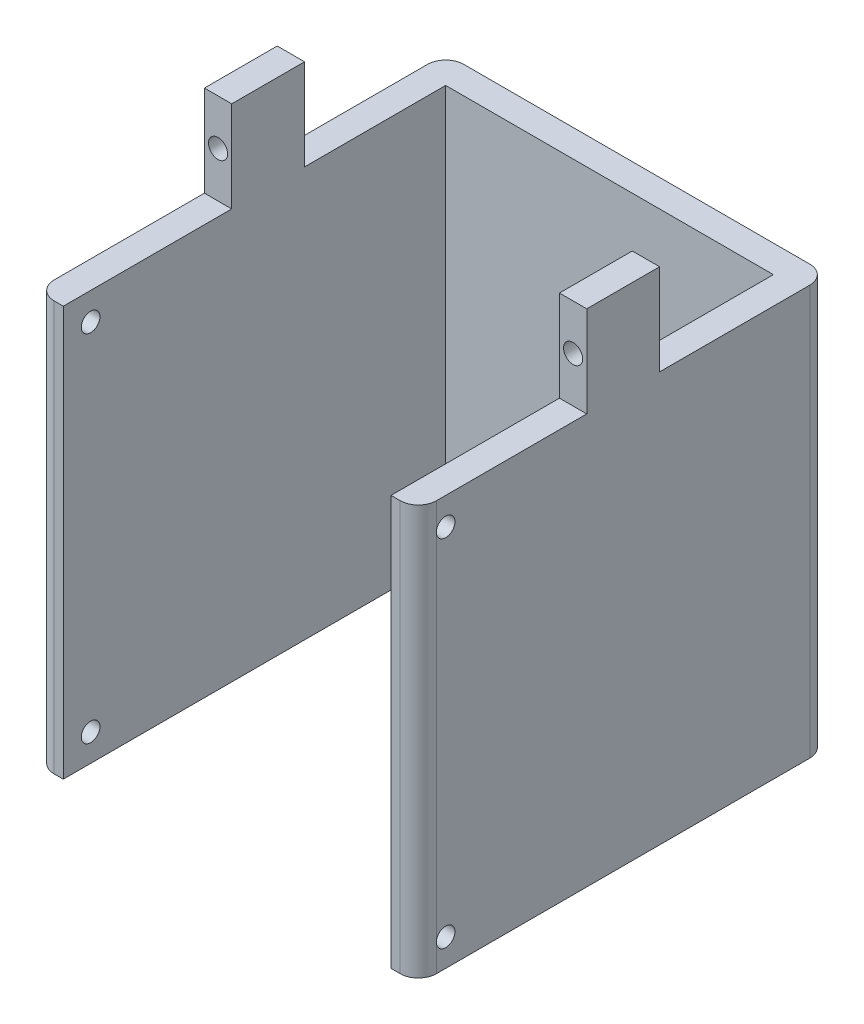
ISO-10303-21;
HEADER;
FILE_DESCRIPTION(('STEP AP214'),'2;1');
FILE_NAME('part.step','',(''),(''),'','','');
FILE_SCHEMA(('AUTOMOTIVE_DESIGN { 1 0 10303 214 1 1 1 1 }'));
ENDSEC;
DATA;
#1=APPLICATION_CONTEXT('core data for automotive mechanical design processes');
#2=APPLICATION_PROTOCOL_DEFINITION('international standard','automotive_design',2000,#1);
#3=PRODUCT_CONTEXT('',#1,'mechanical');
#4=PRODUCT('Part','Part','',(#3));
#5=PRODUCT_RELATED_PRODUCT_CATEGORY('part','',(#4));
#6=PRODUCT_DEFINITION_FORMATION('','',#4);
#7=PRODUCT_DEFINITION_CONTEXT('part definition',#1,'design');
#8=PRODUCT_DEFINITION('design','',#6,#7);
#9=PRODUCT_DEFINITION_SHAPE('','',#8);
#10=(LENGTH_UNIT() NAMED_UNIT(*) SI_UNIT(.MILLI.,.METRE.));
#11=(NAMED_UNIT(*) PLANE_ANGLE_UNIT() SI_UNIT($,.RADIAN.));
#12=(NAMED_UNIT(*) SI_UNIT($,.STERADIAN.) SOLID_ANGLE_UNIT());
#13=UNCERTAINTY_MEASURE_WITH_UNIT(LENGTH_MEASURE(1.E-05),#10,'distance_accuracy_value','');
#14=(GEOMETRIC_REPRESENTATION_CONTEXT(3) GLOBAL_UNCERTAINTY_ASSIGNED_CONTEXT((#13)) GLOBAL_UNIT_ASSIGNED_CONTEXT((#10,
#11,#12)) REPRESENTATION_CONTEXT('',''));
#15=CARTESIAN_POINT('',(0.,0.,0.));
#16=DIRECTION('',(0.,0.,1.));
#17=DIRECTION('',(1.,0.,0.));
#18=AXIS2_PLACEMENT_3D('',#15,#16,#17);
#19=CARTESIAN_POINT('',(-13.5454545454545,-28.0909090909091,38.));
#20=DIRECTION('',(0.,1.,0.));
#21=DIRECTION('',(0.,0.,1.));
#22=AXIS2_PLACEMENT_3D('',#19,#20,#21);
#23=CYLINDRICAL_SURFACE('',#22,2.);
#24=DIRECTION('',(0.,1.,0.));
#25=VECTOR('',#24,1.);
#26=CARTESIAN_POINT('',(-15.5454545454545,-28.0909090909091,38.));
#27=LINE('',#26,#25);
#28=CARTESIAN_POINT('',(-15.5454545454545,-28.0909090909091,38.));
#29=VERTEX_POINT('',#28);
#30=CARTESIAN_POINT('',(-15.5454545454545,-25.3159090909091,38.));
#31=VERTEX_POINT('',#30);
#32=EDGE_CURVE('E442',#29,#31,#27,.T.);
#33=ORIENTED_EDGE('',*,*,#32,.F.);
#34=CARTESIAN_POINT('',(-13.5454545454545,-28.0909090909091,38.));
#35=DIRECTION('',(0.,-1.,0.));
#36=DIRECTION('',(0.,0.,-1.));
#37=AXIS2_PLACEMENT_3D('',#34,#35,#36);
#38=CIRCLE('',#37,2.);
#39=CARTESIAN_POINT('',(-13.5454545454545,-28.0909090909091,40.));
#40=VERTEX_POINT('',#39);
#41=EDGE_CURVE('E44',#40,#29,#38,.T.);
#42=ORIENTED_EDGE('',*,*,#41,.F.);
#43=DIRECTION('',(0.,1.,0.));
#44=VECTOR('',#43,1.);
#45=CARTESIAN_POINT('',(-13.5454545454545,0.,40.));
#46=LINE('',#45,#44);
#47=CARTESIAN_POINT('',(-13.5454545454545,16.9090909090909,40.));
#48=VERTEX_POINT('',#47);
#49=EDGE_CURVE('E428',#48,#40,#46,.F.);
#50=ORIENTED_EDGE('',*,*,#49,.F.);
#51=CARTESIAN_POINT('',(-13.5454545454545,16.9090909090909,38.));
#52=DIRECTION('',(0.,1.,0.));
#53=DIRECTION('',(0.,0.,1.));
#54=AXIS2_PLACEMENT_3D('',#51,#52,#53);
#55=CIRCLE('',#54,2.);
#56=CARTESIAN_POINT('',(-15.5454545454545,16.9090909090909,38.));
#57=VERTEX_POINT('',#56);
#58=EDGE_CURVE('E11',#57,#48,#55,.T.);
#59=ORIENTED_EDGE('',*,*,#58,.F.);
#60=DIRECTION('',(0.,1.,0.));
#61=VECTOR('',#60,1.);
#62=CARTESIAN_POINT('',(-15.5454545454545,-28.0909090909091,38.));
#63=LINE('',#62,#61);
#64=CARTESIAN_POINT('',(-15.5454545454545,14.1340909090909,38.));
#65=VERTEX_POINT('',#64);
#66=EDGE_CURVE('E471',#65,#57,#63,.T.);
#67=ORIENTED_EDGE('',*,*,#66,.F.);
#68=CARTESIAN_POINT('',(-15.5454545454545,13.6840909090909,38.));
#69=CARTESIAN_POINT('',(-15.5454509486003,13.7126078027964,38.0064168164898));
#70=CARTESIAN_POINT('',(-15.5454240768481,13.7413871701402,38.0116095084588));
#71=CARTESIAN_POINT('',(-15.5453638825628,13.7992817057305,38.0195198736351));
#72=CARTESIAN_POINT('',(-15.5453305605444,13.8283968470134,38.0222377441936));
#73=CARTESIAN_POINT('',(-15.5452819861899,13.9143077071115,38.0265566954337));
#74=CARTESIAN_POINT('',(-15.5453134118341,13.9713133459579,38.0246872628044));
#75=CARTESIAN_POINT('',(-15.5454317586012,14.0842271056491,38.0115251227635));
#76=CARTESIAN_POINT('',(-15.545518680604,14.1401352090795,38.0002322659568));
#77=CARTESIAN_POINT('',(-15.545329510473,14.2227506643284,37.9762679396794));
#78=CARTESIAN_POINT('',(-15.5452091314313,14.2504606359999,37.9669257742961));
#79=CARTESIAN_POINT('',(-15.544750165416,14.304983678151,37.9459108658791));
#80=CARTESIAN_POINT('',(-15.5444115551763,14.3317966526792,37.9342378744426));
#81=CARTESIAN_POINT('',(-15.5439108237709,14.3580709330301,37.9214347172229));
#82=B_SPLINE_CURVE_WITH_KNOTS('',3,(#68,#69,#70,#71,#72,#73,#74,#75,#76,#77,#78,#79,#80,#81),
.UNSPECIFIED.,.F.,.F.,(4,2,2,2,2,2,4),(0.,0.0876379687174867,0.175268948251648,
0.345543195462555,0.515820142180702,0.603453215854345,0.691095633826563),.UNSPECIFIED.);
#83=CARTESIAN_POINT('',(-15.5454545454545,13.6840909090909,38.));
#84=VERTEX_POINT('',#83);
#85=EDGE_CURVE('E421',#84,#65,#82,.T.);
#86=ORIENTED_EDGE('',*,*,#85,.F.);
#87=DIRECTION('',(0.,1.,0.));
#88=VECTOR('',#87,1.);
#89=CARTESIAN_POINT('',(-15.5454545454545,-28.0909090909091,38.));
#90=LINE('',#89,#88);
#91=CARTESIAN_POINT('',(-15.5454545454545,-24.8659090909091,38.));
#92=VERTEX_POINT('',#91);
#93=EDGE_CURVE('E445',#92,#84,#90,.T.);
#94=ORIENTED_EDGE('',*,*,#93,.F.);
#95=CARTESIAN_POINT('',(-15.5454545454545,-25.3159090909091,38.));
#96=CARTESIAN_POINT('',(-15.5454509486003,-25.2873921972036,38.0064168164898));
#97=CARTESIAN_POINT('',(-15.5454240768481,-25.2586128298598,38.0116095084588));
#98=CARTESIAN_POINT('',(-15.5453638825628,-25.2007182942695,38.0195198736351));
#99=CARTESIAN_POINT('',(-15.5453305605444,-25.1716031529866,38.0222377441936));
#100=CARTESIAN_POINT('',(-15.5452819861899,-25.0856922928885,38.0265566954337));
#101=CARTESIAN_POINT('',(-15.5453134118341,-25.0286866540421,38.0246872628044));
#102=CARTESIAN_POINT('',(-15.5454317586012,-24.9157728943509,38.0115251227635));
#103=CARTESIAN_POINT('',(-15.545518680604,-24.8598647909205,38.0002322659568));
#104=CARTESIAN_POINT('',(-15.545329510473,-24.7772493356715,37.9762679396794));
#105=CARTESIAN_POINT('',(-15.5452091314313,-24.7495393640001,37.9669257742961));
#106=CARTESIAN_POINT('',(-15.544750165416,-24.695016321849,37.9459108658791));
#107=CARTESIAN_POINT('',(-15.5444115551763,-24.6682033473208,37.9342378744426));
#108=CARTESIAN_POINT('',(-15.5439108237709,-24.6419290669699,37.9214347172229));
#109=B_SPLINE_CURVE_WITH_KNOTS('',3,(#95,#96,#97,#98,#99,#100,#101,#102,#103,#104,#105,#106,
#107,#108),.UNSPECIFIED.,.F.,.F.,(4,2,2,2,2,2,4),(0.,0.0876379687174879,0.175268948251652,
0.345543195462558,0.515820142180715,0.603453215854358,0.691095633826572),.UNSPECIFIED.);
#110=EDGE_CURVE('E429',#31,#92,#109,.T.);
#111=ORIENTED_EDGE('',*,*,#110,.F.);
#112=EDGE_LOOP('',(#33,#42,#50,#59,#67,#86,#94,#111));
#113=FACE_BOUND('',#112,.T.);
#114=ADVANCED_FACE('F36',(#113),#23,.T.);
#115=CARTESIAN_POINT('',(24.4545454545455,-28.0909090909091,38.));
#116=DIRECTION('',(0.,1.,0.));
#117=DIRECTION('',(0.,0.,1.));
#118=AXIS2_PLACEMENT_3D('',#115,#116,#117);
#119=CYLINDRICAL_SURFACE('',#118,2.);
#120=DIRECTION('',(0.,-1.,0.));
#121=VECTOR('',#120,1.);
#122=CARTESIAN_POINT('',(26.4545454545455,-28.0909090909091,38.));
#123=LINE('',#122,#121);
#124=CARTESIAN_POINT('',(26.4545454545455,16.9090909090909,38.));
#125=VERTEX_POINT('',#124);
#126=CARTESIAN_POINT('',(26.4545454545455,14.1340909090909,38.));
#127=VERTEX_POINT('',#126);
#128=EDGE_CURVE('E387',#125,#127,#123,.T.);
#129=ORIENTED_EDGE('',*,*,#128,.F.);
#130=CARTESIAN_POINT('',(24.4545454545455,16.9090909090909,38.));
#131=DIRECTION('',(0.,1.,0.));
#132=DIRECTION('',(0.,0.,1.));
#133=AXIS2_PLACEMENT_3D('',#130,#131,#132);
#134=CIRCLE('',#133,2.);
#135=CARTESIAN_POINT('',(24.4545454545455,16.9090909090909,40.));
#136=VERTEX_POINT('',#135);
#137=EDGE_CURVE('E472',#136,#125,#134,.T.);
#138=ORIENTED_EDGE('',*,*,#137,.F.);
#139=DIRECTION('',(0.,-1.,0.));
#140=VECTOR('',#139,1.);
#141=CARTESIAN_POINT('',(24.4545454545455,-28.0909090909091,40.));
#142=LINE('',#141,#140);
#143=CARTESIAN_POINT('',(24.4545454545455,-28.0909090909091,40.));
#144=VERTEX_POINT('',#143);
#145=EDGE_CURVE('E475',#144,#136,#142,.F.);
#146=ORIENTED_EDGE('',*,*,#145,.F.);
#147=CARTESIAN_POINT('',(24.4545454545455,-28.0909090909091,38.));
#148=DIRECTION('',(0.,-1.,0.));
#149=DIRECTION('',(0.,0.,-1.));
#150=AXIS2_PLACEMENT_3D('',#147,#148,#149);
#151=CIRCLE('',#150,2.);
#152=CARTESIAN_POINT('',(26.4545454545455,-28.0909090909091,38.));
#153=VERTEX_POINT('',#152);
#154=EDGE_CURVE('E466',#153,#144,#151,.T.);
#155=ORIENTED_EDGE('',*,*,#154,.F.);
#156=DIRECTION('',(0.,-1.,0.));
#157=VECTOR('',#156,1.);
#158=CARTESIAN_POINT('',(26.4545454545455,-28.0909090909091,38.));
#159=LINE('',#158,#157);
#160=CARTESIAN_POINT('',(26.4545454545455,-25.3159090909091,38.));
#161=VERTEX_POINT('',#160);
#162=EDGE_CURVE('E381',#161,#153,#159,.T.);
#163=ORIENTED_EDGE('',*,*,#162,.F.);
#164=CARTESIAN_POINT('',(26.4545454545455,-24.8659090909091,38.));
#165=CARTESIAN_POINT('',(26.4545418576912,-24.8944259846145,38.0064168164898));
#166=CARTESIAN_POINT('',(26.454514985939,-24.9232053519584,38.0116095084588));
#167=CARTESIAN_POINT('',(26.4544547916537,-24.9810998875486,38.0195198736351));
#168=CARTESIAN_POINT('',(26.4544214696353,-25.0102150288316,38.0222377441936));
#169=CARTESIAN_POINT('',(26.4543728952808,-25.0961258889297,38.0265566954337));
#170=CARTESIAN_POINT('',(26.454404320925,-25.1531315277761,38.0246872628044));
#171=CARTESIAN_POINT('',(26.4545226676921,-25.2660452874673,38.0115251227635));
#172=CARTESIAN_POINT('',(26.4546095896949,-25.3219533908977,38.0002322659568));
#173=CARTESIAN_POINT('',(26.454420419564,-25.4045688461466,37.9762679396794));
#174=CARTESIAN_POINT('',(26.4543000405222,-25.4322788178181,37.9669257742961));
#175=CARTESIAN_POINT('',(26.4538410745069,-25.4868018599692,37.9459108658791));
#176=CARTESIAN_POINT('',(26.4535024642672,-25.5136148344973,37.9342378744426));
#177=CARTESIAN_POINT('',(26.4530017328618,-25.5398891148483,37.9214347172229));
#178=B_SPLINE_CURVE_WITH_KNOTS('',3,(#164,#165,#166,#167,#168,#169,#170,#171,#172,#173,#174,
#175,#176,#177),.UNSPECIFIED.,.F.,.F.,(4,2,2,2,2,2,4),(0.,0.0876379687174833,0.175268948251648,
0.345543195462557,0.515820142180701,0.603453215854352,0.691095633826572),.UNSPECIFIED.);
#179=CARTESIAN_POINT('',(26.4545454545455,-24.8659090909091,38.));
#180=VERTEX_POINT('',#179);
#181=EDGE_CURVE('E397',#180,#161,#178,.T.);
#182=ORIENTED_EDGE('',*,*,#181,.F.);
#183=DIRECTION('',(0.,-1.,0.));
#184=VECTOR('',#183,1.);
#185=CARTESIAN_POINT('',(26.4545454545455,-28.0909090909091,38.));
#186=LINE('',#185,#184);
#187=CARTESIAN_POINT('',(26.4545454545455,13.6840909090909,38.));
#188=VERTEX_POINT('',#187);
#189=EDGE_CURVE('E384',#188,#180,#186,.T.);
#190=ORIENTED_EDGE('',*,*,#189,.F.);
#191=CARTESIAN_POINT('',(26.4545454545455,14.1340909090909,38.));
#192=CARTESIAN_POINT('',(26.4545418576912,14.1055740153855,38.0064168164898));
#193=CARTESIAN_POINT('',(26.454514985939,14.0767946480416,38.0116095084588));
#194=CARTESIAN_POINT('',(26.4544547916537,14.0189001124514,38.0195198736351));
#195=CARTESIAN_POINT('',(26.4544214696353,13.9897849711684,38.0222377441936));
#196=CARTESIAN_POINT('',(26.4543728952808,13.9038741110704,38.0265566954337));
#197=CARTESIAN_POINT('',(26.454404320925,13.8468684722239,38.0246872628044));
#198=CARTESIAN_POINT('',(26.4545226676921,13.7339547125327,38.0115251227635));
#199=CARTESIAN_POINT('',(26.4546095896949,13.6780466091023,38.0002322659568));
#200=CARTESIAN_POINT('',(26.454420419564,13.5954311538534,37.9762679396794));
#201=CARTESIAN_POINT('',(26.4543000405222,13.5677211821819,37.9669257742961));
#202=CARTESIAN_POINT('',(26.4538410745069,13.5131981400308,37.9459108658791));
#203=CARTESIAN_POINT('',(26.4535024642672,13.4863851655027,37.9342378744426));
#204=CARTESIAN_POINT('',(26.4530017328618,13.4601108851518,37.9214347172229));
#205=B_SPLINE_CURVE_WITH_KNOTS('',3,(#191,#192,#193,#194,#195,#196,#197,#198,#199,#200,#201,
#202,#203,#204),.UNSPECIFIED.,.F.,.F.,(4,2,2,2,2,2,4),(0.,0.087637968717485,0.175268948251646,
0.345543195462555,0.515820142180707,0.603453215854347,0.691095633826563),.UNSPECIFIED.);
#206=EDGE_CURVE('E390',#127,#188,#205,.T.);
#207=ORIENTED_EDGE('',*,*,#206,.F.);
#208=EDGE_LOOP('',(#129,#138,#146,#155,#163,#182,#190,#207));
#209=FACE_BOUND('',#208,.T.);
#210=ADVANCED_FACE('F404',(#209),#119,.T.);
#211=CARTESIAN_POINT('',(-13.5454545454545,0.,-3.));
#212=DIRECTION('',(0.,-1.,0.));
#213=DIRECTION('',(0.,0.,-1.));
#214=AXIS2_PLACEMENT_3D('',#211,#212,#213);
#215=CYLINDRICAL_SURFACE('',#214,2.);
#216=DIRECTION('',(0.,1.,0.));
#217=VECTOR('',#216,1.);
#218=CARTESIAN_POINT('',(-13.5454545454545,0.,-5.));
#219=LINE('',#218,#217);
#220=CARTESIAN_POINT('',(-13.5454545454545,-28.0909090909091,-5.));
#221=VERTEX_POINT('',#220);
#222=CARTESIAN_POINT('',(-13.5454545454545,16.9090909090909,-5.));
#223=VERTEX_POINT('',#222);
#224=EDGE_CURVE('E371',#221,#223,#219,.T.);
#225=ORIENTED_EDGE('',*,*,#224,.F.);
#226=CARTESIAN_POINT('',(-13.5454545454545,-28.0909090909091,-3.));
#227=DIRECTION('',(0.,-1.,0.));
#228=DIRECTION('',(0.,0.,-1.));
#229=AXIS2_PLACEMENT_3D('',#226,#227,#228);
#230=CIRCLE('',#229,2.);
#231=CARTESIAN_POINT('',(-15.5454545454545,-28.0909090909091,-3.));
#232=VERTEX_POINT('',#231);
#233=EDGE_CURVE('E377',#232,#221,#230,.T.);
#234=ORIENTED_EDGE('',*,*,#233,.F.);
#235=DIRECTION('',(0.,1.,0.));
#236=VECTOR('',#235,1.);
#237=CARTESIAN_POINT('',(-15.5454545454545,0.,-3.));
#238=LINE('',#237,#236);
#239=CARTESIAN_POINT('',(-15.5454545454545,16.9090909090909,-3.));
#240=VERTEX_POINT('',#239);
#241=EDGE_CURVE('E374',#240,#232,#238,.F.);
#242=ORIENTED_EDGE('',*,*,#241,.F.);
#243=CARTESIAN_POINT('',(-13.5454545454545,16.9090909090909,-3.));
#244=DIRECTION('',(0.,1.,0.));
#245=DIRECTION('',(0.,0.,1.));
#246=AXIS2_PLACEMENT_3D('',#243,#244,#245);
#247=CIRCLE('',#246,2.);
#248=EDGE_CURVE('E379',#223,#240,#247,.T.);
#249=ORIENTED_EDGE('',*,*,#248,.F.);
#250=EDGE_LOOP('',(#225,#234,#242,#249));
#251=FACE_BOUND('',#250,.T.);
#252=ADVANCED_FACE('F450',(#251),#215,.T.);
#253=CARTESIAN_POINT('',(24.4545454545455,0.,-3.));
#254=DIRECTION('',(0.,-1.,0.));
#255=DIRECTION('',(0.,0.,-1.));
#256=AXIS2_PLACEMENT_3D('',#253,#254,#255);
#257=CYLINDRICAL_SURFACE('',#256,2.);
#258=DIRECTION('',(0.,-1.,0.));
#259=VECTOR('',#258,1.);
#260=CARTESIAN_POINT('',(24.4545454545455,0.,-5.));
#261=LINE('',#260,#259);
#262=CARTESIAN_POINT('',(24.4545454545455,16.9090909090909,-5.));
#263=VERTEX_POINT('',#262);
#264=CARTESIAN_POINT('',(24.4545454545455,-28.0909090909091,-5.));
#265=VERTEX_POINT('',#264);
#266=EDGE_CURVE('E351',#263,#265,#261,.T.);
#267=ORIENTED_EDGE('',*,*,#266,.F.);
#268=CARTESIAN_POINT('',(24.4545454545455,16.9090909090909,-3.));
#269=DIRECTION('',(0.,1.,0.));
#270=DIRECTION('',(0.,0.,1.));
#271=AXIS2_PLACEMENT_3D('',#268,#269,#270);
#272=CIRCLE('',#271,2.);
#273=CARTESIAN_POINT('',(26.4545454545455,16.9090909090909,-3.));
#274=VERTEX_POINT('',#273);
#275=EDGE_CURVE('E366',#274,#263,#272,.T.);
#276=ORIENTED_EDGE('',*,*,#275,.F.);
#277=DIRECTION('',(0.,-1.,0.));
#278=VECTOR('',#277,1.);
#279=CARTESIAN_POINT('',(26.4545454545455,-28.0909090909091,-3.));
#280=LINE('',#279,#278);
#281=CARTESIAN_POINT('',(26.4545454545455,-28.0909090909091,-3.));
#282=VERTEX_POINT('',#281);
#283=EDGE_CURVE('E363',#282,#274,#280,.F.);
#284=ORIENTED_EDGE('',*,*,#283,.F.);
#285=CARTESIAN_POINT('',(24.4545454545455,-28.0909090909091,-3.));
#286=DIRECTION('',(0.,-1.,0.));
#287=DIRECTION('',(0.,0.,-1.));
#288=AXIS2_PLACEMENT_3D('',#285,#286,#287);
#289=CIRCLE('',#288,2.);
#290=EDGE_CURVE('E369',#265,#282,#289,.T.);
#291=ORIENTED_EDGE('',*,*,#290,.F.);
#292=EDGE_LOOP('',(#267,#276,#284,#291));
#293=FACE_BOUND('',#292,.T.);
#294=ADVANCED_FACE('F458',(#293),#257,.T.);
#295=CARTESIAN_POINT('',(26.4545454545455,16.9090909090909,-5.));
#296=DIRECTION('',(0.,1.,0.));
#297=DIRECTION('',(0.,0.,1.));
#298=AXIS2_PLACEMENT_3D('',#295,#296,#297);
#299=PLANE('',#298);
#300=DIRECTION('',(0.,0.,1.));
#301=VECTOR('',#300,1.);
#302=CARTESIAN_POINT('',(-15.5454545454545,16.9090909090909,-5.));
#303=LINE('',#302,#301);
#304=CARTESIAN_POINT('',(-15.5454545454545,16.9090909090909,21.5));
#305=VERTEX_POINT('',#304);
#306=EDGE_CURVE('E231',#305,#57,#303,.T.);
#307=ORIENTED_EDGE('',*,*,#306,.T.);
#308=ORIENTED_EDGE('',*,*,#58,.T.);
#309=DIRECTION('',(1.,0.,0.));
#310=VECTOR('',#309,1.);
#311=CARTESIAN_POINT('',(-15.5454545454545,16.9090909090909,40.));
#312=LINE('',#311,#310);
#313=CARTESIAN_POINT('',(-12.5454545454545,16.9090909090909,40.));
#314=VERTEX_POINT('',#313);
#315=EDGE_CURVE('E326',#48,#314,#312,.T.);
#316=ORIENTED_EDGE('',*,*,#315,.T.);
#317=DIRECTION('',(0.,0.,1.));
#318=VECTOR('',#317,1.);
#319=CARTESIAN_POINT('',(-12.5454545454545,16.9090909090909,3.));
#320=LINE('',#319,#318);
#321=CARTESIAN_POINT('',(-12.5454545454545,16.9090909090909,21.5));
#322=VERTEX_POINT('',#321);
#323=EDGE_CURVE('E301',#322,#314,#320,.T.);
#324=ORIENTED_EDGE('',*,*,#323,.F.);
#325=DIRECTION('',(1.,0.,0.));
#326=VECTOR('',#325,1.);
#327=CARTESIAN_POINT('',(-15.5454545454545,16.9090909090909,21.5));
#328=LINE('',#327,#326);
#329=EDGE_CURVE('E359',#305,#322,#328,.T.);
#330=ORIENTED_EDGE('',*,*,#329,.F.);
#331=EDGE_LOOP('',(#307,#308,#316,#324,#330));
#332=FACE_BOUND('',#331,.T.);
#333=ADVANCED_FACE('F526',(#332),#299,.T.);
#334=DIRECTION('',(1.,0.,0.));
#335=VECTOR('',#334,1.);
#336=CARTESIAN_POINT('',(-15.5454545454545,16.9090909090909,-5.));
#337=LINE('',#336,#335);
#338=EDGE_CURVE('E331',#223,#263,#337,.T.);
#339=ORIENTED_EDGE('',*,*,#338,.F.);
#340=ORIENTED_EDGE('',*,*,#248,.T.);
#341=CARTESIAN_POINT('',(-15.5454545454545,16.9090909090909,13.5));
#342=VERTEX_POINT('',#341);
#343=EDGE_CURVE('E339',#240,#342,#303,.T.);
#344=ORIENTED_EDGE('',*,*,#343,.T.);
#345=DIRECTION('',(-1.,0.,0.));
#346=VECTOR('',#345,1.);
#347=CARTESIAN_POINT('',(-15.5454545454545,16.9090909090909,13.5));
#348=LINE('',#347,#346);
#349=CARTESIAN_POINT('',(-12.5454545454545,16.9090909090909,13.5));
#350=VERTEX_POINT('',#349);
#351=EDGE_CURVE('E225',#350,#342,#348,.T.);
#352=ORIENTED_EDGE('',*,*,#351,.F.);
#353=CARTESIAN_POINT('',(-12.5454545454545,16.9090909090909,-2.));
#354=VERTEX_POINT('',#353);
#355=EDGE_CURVE('E304',#354,#350,#320,.T.);
#356=ORIENTED_EDGE('',*,*,#355,.F.);
#357=DIRECTION('',(-1.,0.,0.));
#358=VECTOR('',#357,1.);
#359=CARTESIAN_POINT('',(-12.5454545454545,16.9090909090909,-2.));
#360=LINE('',#359,#358);
#361=CARTESIAN_POINT('',(23.4545454545454,16.9090909090909,-2.));
#362=VERTEX_POINT('',#361);
#363=EDGE_CURVE('E284',#362,#354,#360,.T.);
#364=ORIENTED_EDGE('',*,*,#363,.F.);
#365=DIRECTION('',(0.,0.,-1.));
#366=VECTOR('',#365,1.);
#367=CARTESIAN_POINT('',(23.4545454545455,16.9090909090909,3.));
#368=LINE('',#367,#366);
#369=CARTESIAN_POINT('',(23.4545454545455,16.9090909090909,13.5));
#370=VERTEX_POINT('',#369);
#371=EDGE_CURVE('E307',#370,#362,#368,.T.);
#372=ORIENTED_EDGE('',*,*,#371,.F.);
#373=DIRECTION('',(-1.,0.,0.));
#374=VECTOR('',#373,1.);
#375=CARTESIAN_POINT('',(26.4545454545455,16.9090909090909,13.5));
#376=LINE('',#375,#374);
#377=CARTESIAN_POINT('',(26.4545454545455,16.9090909090909,13.5));
#378=VERTEX_POINT('',#377);
#379=EDGE_CURVE('E232',#378,#370,#376,.T.);
#380=ORIENTED_EDGE('',*,*,#379,.F.);
#381=DIRECTION('',(0.,0.,1.));
#382=VECTOR('',#381,1.);
#383=CARTESIAN_POINT('',(26.4545454545455,16.9090909090909,-5.));
#384=LINE('',#383,#382);
#385=EDGE_CURVE('E337',#274,#378,#384,.T.);
#386=ORIENTED_EDGE('',*,*,#385,.F.);
#387=ORIENTED_EDGE('',*,*,#275,.T.);
#388=EDGE_LOOP('',(#339,#340,#344,#352,#356,#364,#372,#380,#386,#387));
#389=FACE_BOUND('',#388,.T.);
#390=ADVANCED_FACE('F502',(#389),#299,.T.);
#391=CARTESIAN_POINT('',(23.4545454545455,16.9090909090909,40.));
#392=VERTEX_POINT('',#391);
#393=EDGE_CURVE('E325',#392,#136,#312,.T.);
#394=ORIENTED_EDGE('',*,*,#393,.T.);
#395=ORIENTED_EDGE('',*,*,#137,.T.);
#396=CARTESIAN_POINT('',(26.4545454545455,16.9090909090909,21.5));
#397=VERTEX_POINT('',#396);
#398=EDGE_CURVE('E336',#397,#125,#384,.T.);
#399=ORIENTED_EDGE('',*,*,#398,.F.);
#400=DIRECTION('',(1.,0.,0.));
#401=VECTOR('',#400,1.);
#402=CARTESIAN_POINT('',(26.4545454545455,16.9090909090909,21.5));
#403=LINE('',#402,#401);
#404=CARTESIAN_POINT('',(23.4545454545455,16.9090909090909,21.5));
#405=VERTEX_POINT('',#404);
#406=EDGE_CURVE('E235',#405,#397,#403,.T.);
#407=ORIENTED_EDGE('',*,*,#406,.F.);
#408=EDGE_CURVE('E308',#392,#405,#368,.T.);
#409=ORIENTED_EDGE('',*,*,#408,.F.);
#410=EDGE_LOOP('',(#394,#395,#399,#407,#409));
#411=FACE_BOUND('',#410,.T.);
#412=ADVANCED_FACE('F487',(#411),#299,.T.);
#413=CARTESIAN_POINT('',(0.,0.,40.));
#414=DIRECTION('',(0.,0.,-1.));
#415=DIRECTION('',(-1.,0.,0.));
#416=AXIS2_PLACEMENT_3D('',#413,#414,#415);
#417=PLANE('',#416);
#418=ORIENTED_EDGE('',*,*,#315,.F.);
#419=ORIENTED_EDGE('',*,*,#49,.T.);
#420=DIRECTION('',(-1.,0.,0.));
#421=VECTOR('',#420,1.);
#422=CARTESIAN_POINT('',(-14.5454545454545,-28.0909090909091,40.));
#423=LINE('',#422,#421);
#424=CARTESIAN_POINT('',(-12.5454545454545,-28.0909090909091,40.));
#425=VERTEX_POINT('',#424);
#426=EDGE_CURVE('E322',#425,#40,#423,.T.);
#427=ORIENTED_EDGE('',*,*,#426,.F.);
#428=DIRECTION('',(0.,1.,0.));
#429=VECTOR('',#428,1.);
#430=CARTESIAN_POINT('',(-12.5454545454545,0.,40.));
#431=LINE('',#430,#429);
#432=EDGE_CURVE('E346',#425,#314,#431,.T.);
#433=ORIENTED_EDGE('',*,*,#432,.T.);
#434=EDGE_LOOP('',(#418,#419,#427,#433));
#435=FACE_BOUND('',#434,.T.);
#436=ADVANCED_FACE('F521',(#435),#417,.F.);
#437=CARTESIAN_POINT('',(-15.5454545454545,-28.0909090909091,-5.));
#438=DIRECTION('',(1.,0.,0.));
#439=DIRECTION('',(0.,0.,-1.));
#440=AXIS2_PLACEMENT_3D('',#437,#438,#439);
#441=PLANE('',#440);
#442=DIRECTION('',(0.,0.,1.));
#443=VECTOR('',#442,1.);
#444=CARTESIAN_POINT('',(-15.5454545454545,-28.0909090909091,-5.));
#445=LINE('',#444,#443);
#446=EDGE_CURVE('E341',#232,#29,#445,.T.);
#447=ORIENTED_EDGE('',*,*,#446,.T.);
#448=ORIENTED_EDGE('',*,*,#32,.T.);
#449=CARTESIAN_POINT('',(-15.5454545454545,-25.0909090909091,37.));
#450=DIRECTION('',(-1.,0.,0.));
#451=DIRECTION('',(0.,0.,1.));
#452=AXIS2_PLACEMENT_3D('',#449,#450,#451);
#453=CIRCLE('',#452,1.025);
#454=EDGE_CURVE('E265',#92,#31,#453,.T.);
#455=ORIENTED_EDGE('',*,*,#454,.F.);
#456=ORIENTED_EDGE('',*,*,#93,.T.);
#457=CARTESIAN_POINT('',(-15.5454545454545,13.9090909090909,37.));
#458=DIRECTION('',(-1.,0.,0.));
#459=DIRECTION('',(0.,0.,1.));
#460=AXIS2_PLACEMENT_3D('',#457,#458,#459);
#461=CIRCLE('',#460,1.025);
#462=EDGE_CURVE('E264',#65,#84,#461,.T.);
#463=ORIENTED_EDGE('',*,*,#462,.F.);
#464=ORIENTED_EDGE('',*,*,#66,.T.);
#465=ORIENTED_EDGE('',*,*,#306,.F.);
#466=DIRECTION('',(0.,-1.,0.));
#467=VECTOR('',#466,1.);
#468=CARTESIAN_POINT('',(-15.5454545454545,26.9090909090909,21.5));
#469=LINE('',#468,#467);
#470=CARTESIAN_POINT('',(-15.5454545454545,26.9090909090909,21.5));
#471=VERTEX_POINT('',#470);
#472=EDGE_CURVE('E210',#471,#305,#469,.T.);
#473=ORIENTED_EDGE('',*,*,#472,.F.);
#474=DIRECTION('',(0.,0.,1.));
#475=VECTOR('',#474,1.);
#476=CARTESIAN_POINT('',(-15.5454545454545,26.9090909090909,13.5));
#477=LINE('',#476,#475);
#478=CARTESIAN_POINT('',(-15.5454545454545,26.9090909090909,13.5));
#479=VERTEX_POINT('',#478);
#480=EDGE_CURVE('E216',#479,#471,#477,.T.);
#481=ORIENTED_EDGE('',*,*,#480,.F.);
#482=DIRECTION('',(0.,-1.,0.));
#483=VECTOR('',#482,1.);
#484=CARTESIAN_POINT('',(-15.5454545454545,26.9090909090909,13.5));
#485=LINE('',#484,#483);
#486=EDGE_CURVE('E534',#479,#342,#485,.T.);
#487=ORIENTED_EDGE('',*,*,#486,.T.);
#488=ORIENTED_EDGE('',*,*,#343,.F.);
#489=ORIENTED_EDGE('',*,*,#241,.T.);
#490=EDGE_LOOP('',(#447,#448,#455,#456,#463,#464,#465,#473,#481,#487,#488,#489));
#491=FACE_BOUND('',#490,.T.);
#492=ADVANCED_FACE('F229',(#491),#441,.F.);
#493=CARTESIAN_POINT('',(26.4545454545455,-28.0909090909091,-5.));
#494=DIRECTION('',(1.,0.,0.));
#495=DIRECTION('',(0.,0.,-1.));
#496=AXIS2_PLACEMENT_3D('',#493,#494,#495);
#497=PLANE('',#496);
#498=ORIENTED_EDGE('',*,*,#398,.T.);
#499=ORIENTED_EDGE('',*,*,#128,.T.);
#500=CARTESIAN_POINT('',(26.4545454545455,13.9090909090909,37.));
#501=DIRECTION('',(1.,0.,0.));
#502=DIRECTION('',(0.,0.,-1.));
#503=AXIS2_PLACEMENT_3D('',#500,#501,#502);
#504=CIRCLE('',#503,1.025);
#505=EDGE_CURVE('E274',#188,#127,#504,.T.);
#506=ORIENTED_EDGE('',*,*,#505,.F.);
#507=ORIENTED_EDGE('',*,*,#189,.T.);
#508=CARTESIAN_POINT('',(26.4545454545455,-25.0909090909091,37.));
#509=DIRECTION('',(1.,0.,0.));
#510=DIRECTION('',(0.,0.,-1.));
#511=AXIS2_PLACEMENT_3D('',#508,#509,#510);
#512=CIRCLE('',#511,1.025);
#513=EDGE_CURVE('E281',#161,#180,#512,.T.);
#514=ORIENTED_EDGE('',*,*,#513,.F.);
#515=ORIENTED_EDGE('',*,*,#162,.T.);
#516=DIRECTION('',(0.,0.,1.));
#517=VECTOR('',#516,1.);
#518=CARTESIAN_POINT('',(26.4545454545455,-28.0909090909091,-5.));
#519=LINE('',#518,#517);
#520=EDGE_CURVE('E333',#282,#153,#519,.T.);
#521=ORIENTED_EDGE('',*,*,#520,.F.);
#522=ORIENTED_EDGE('',*,*,#283,.T.);
#523=ORIENTED_EDGE('',*,*,#385,.T.);
#524=DIRECTION('',(0.,-1.,0.));
#525=VECTOR('',#524,1.);
#526=CARTESIAN_POINT('',(26.4545454545455,26.9090909090909,13.5));
#527=LINE('',#526,#525);
#528=CARTESIAN_POINT('',(26.4545454545455,26.9090909090909,13.5));
#529=VERTEX_POINT('',#528);
#530=EDGE_CURVE('E261',#529,#378,#527,.T.);
#531=ORIENTED_EDGE('',*,*,#530,.F.);
#532=DIRECTION('',(0.,0.,-1.));
#533=VECTOR('',#532,1.);
#534=CARTESIAN_POINT('',(26.4545454545455,26.9090909090909,13.5));
#535=LINE('',#534,#533);
#536=CARTESIAN_POINT('',(26.4545454545455,26.9090909090909,21.5));
#537=VERTEX_POINT('',#536);
#538=EDGE_CURVE('E241',#537,#529,#535,.T.);
#539=ORIENTED_EDGE('',*,*,#538,.F.);
#540=DIRECTION('',(0.,-1.,0.));
#541=VECTOR('',#540,1.);
#542=CARTESIAN_POINT('',(26.4545454545455,26.9090909090909,21.5));
#543=LINE('',#542,#541);
#544=EDGE_CURVE('E249',#537,#397,#543,.T.);
#545=ORIENTED_EDGE('',*,*,#544,.T.);
#546=EDGE_LOOP('',(#498,#499,#506,#507,#514,#515,#521,#522,#523,#531,#539,#545));
#547=FACE_BOUND('',#546,.T.);
#548=ADVANCED_FACE('F463',(#547),#497,.T.);
#549=CARTESIAN_POINT('',(-14.5454545454545,-28.0909090909091,-5.));
#550=DIRECTION('',(0.,-1.,0.));
#551=DIRECTION('',(0.,0.,-1.));
#552=AXIS2_PLACEMENT_3D('',#549,#550,#551);
#553=PLANE('',#552);
#554=ORIENTED_EDGE('',*,*,#426,.T.);
#555=ORIENTED_EDGE('',*,*,#41,.T.);
#556=ORIENTED_EDGE('',*,*,#446,.F.);
#557=ORIENTED_EDGE('',*,*,#233,.T.);
#558=DIRECTION('',(-1.,0.,0.));
#559=VECTOR('',#558,1.);
#560=CARTESIAN_POINT('',(-14.5454545454545,-28.0909090909091,-5.));
#561=LINE('',#560,#559);
#562=EDGE_CURVE('E328',#265,#221,#561,.T.);
#563=ORIENTED_EDGE('',*,*,#562,.F.);
#564=ORIENTED_EDGE('',*,*,#290,.T.);
#565=ORIENTED_EDGE('',*,*,#520,.T.);
#566=ORIENTED_EDGE('',*,*,#154,.T.);
#567=CARTESIAN_POINT('',(23.4545454545455,-28.0909090909091,40.));
#568=VERTEX_POINT('',#567);
#569=EDGE_CURVE('E323',#144,#568,#423,.T.);
#570=ORIENTED_EDGE('',*,*,#569,.T.);
#571=DIRECTION('',(0.,0.,1.));
#572=VECTOR('',#571,1.);
#573=CARTESIAN_POINT('',(23.4545454545455,-28.0909090909091,-5.00000000000001));
#574=LINE('',#573,#572);
#575=CARTESIAN_POINT('',(23.4545454545455,-28.0909090909091,3.));
#576=VERTEX_POINT('',#575);
#577=EDGE_CURVE('E315',#576,#568,#574,.T.);
#578=ORIENTED_EDGE('',*,*,#577,.F.);
#579=DIRECTION('',(1.,0.,0.));
#580=VECTOR('',#579,1.);
#581=CARTESIAN_POINT('',(-14.5454545454545,-28.0909090909091,3.));
#582=LINE('',#581,#580);
#583=CARTESIAN_POINT('',(-12.5454545454545,-28.0909090909091,3.));
#584=VERTEX_POINT('',#583);
#585=EDGE_CURVE('E349',#584,#576,#582,.T.);
#586=ORIENTED_EDGE('',*,*,#585,.F.);
#587=DIRECTION('',(0.,0.,-1.));
#588=VECTOR('',#587,1.);
#589=CARTESIAN_POINT('',(-12.5454545454545,-28.0909090909091,-5.));
#590=LINE('',#589,#588);
#591=EDGE_CURVE('E320',#425,#584,#590,.T.);
#592=ORIENTED_EDGE('',*,*,#591,.F.);
#593=EDGE_LOOP('',(#554,#555,#556,#557,#563,#564,#565,#566,#570,#578,#586,#592));
#594=FACE_BOUND('',#593,.T.);
#595=ADVANCED_FACE('F438',(#594),#553,.T.);
#596=CARTESIAN_POINT('',(0.,0.,-5.));
#597=DIRECTION('',(0.,0.,-1.));
#598=DIRECTION('',(-1.,0.,0.));
#599=AXIS2_PLACEMENT_3D('',#596,#597,#598);
#600=PLANE('',#599);
#601=ORIENTED_EDGE('',*,*,#562,.T.);
#602=ORIENTED_EDGE('',*,*,#224,.T.);
#603=ORIENTED_EDGE('',*,*,#338,.T.);
#604=ORIENTED_EDGE('',*,*,#266,.T.);
#605=EDGE_LOOP('',(#601,#602,#603,#604));
#606=FACE_BOUND('',#605,.T.);
#607=ADVANCED_FACE('F454',(#606),#600,.T.);
#608=ORIENTED_EDGE('',*,*,#569,.F.);
#609=ORIENTED_EDGE('',*,*,#145,.T.);
#610=ORIENTED_EDGE('',*,*,#393,.F.);
#611=DIRECTION('',(0.,-1.,0.));
#612=VECTOR('',#611,1.);
#613=CARTESIAN_POINT('',(23.4545454545455,0.,40.));
#614=LINE('',#613,#612);
#615=EDGE_CURVE('E343',#392,#568,#614,.T.);
#616=ORIENTED_EDGE('',*,*,#615,.T.);
#617=EDGE_LOOP('',(#608,#609,#610,#616));
#618=FACE_BOUND('',#617,.T.);
#619=ADVANCED_FACE('F480',(#618),#417,.F.);
#620=CARTESIAN_POINT('',(-12.5454545454545,-33.0909090909091,3.));
#621=DIRECTION('',(-1.,0.,0.));
#622=DIRECTION('',(0.,0.,1.));
#623=AXIS2_PLACEMENT_3D('',#620,#621,#622);
#624=PLANE('',#623);
#625=CARTESIAN_POINT('',(-12.5454545454545,-25.0909090909091,37.));
#626=DIRECTION('',(-1.,0.,0.));
#627=DIRECTION('',(0.,0.,1.));
#628=AXIS2_PLACEMENT_3D('',#625,#626,#627);
#629=CIRCLE('',#628,1.025);
#630=CARTESIAN_POINT('',(-12.5454545454545,-25.0909090909091,38.025));
#631=VERTEX_POINT('',#630);
#632=EDGE_CURVE('E278',#631,#631,#629,.T.);
#633=ORIENTED_EDGE('',*,*,#632,.T.);
#634=EDGE_LOOP('',(#633));
#635=FACE_BOUND('',#634,.T.);
#636=CARTESIAN_POINT('',(-12.5454545454545,13.9090909090909,37.));
#637=DIRECTION('',(-1.,0.,0.));
#638=DIRECTION('',(0.,0.,1.));
#639=AXIS2_PLACEMENT_3D('',#636,#637,#638);
#640=CIRCLE('',#639,1.025);
#641=CARTESIAN_POINT('',(-12.5454545454545,13.9090909090909,38.025));
#642=VERTEX_POINT('',#641);
#643=EDGE_CURVE('E271',#642,#642,#640,.T.);
#644=ORIENTED_EDGE('',*,*,#643,.T.);
#645=EDGE_LOOP('',(#644));
#646=FACE_BOUND('',#645,.T.);
#647=ORIENTED_EDGE('',*,*,#591,.T.);
#648=DIRECTION('',(0.,1.,0.));
#649=VECTOR('',#648,1.);
#650=CARTESIAN_POINT('',(-12.5454545454545,-33.0909090909091,3.));
#651=LINE('',#650,#649);
#652=CARTESIAN_POINT('',(-12.5454545454545,-26.0909090909091,3.));
#653=VERTEX_POINT('',#652);
#654=EDGE_CURVE('E312',#584,#653,#651,.T.);
#655=ORIENTED_EDGE('',*,*,#654,.T.);
#656=DIRECTION('',(0.,0.,1.));
#657=VECTOR('',#656,1.);
#658=CARTESIAN_POINT('',(-12.5454545454545,-26.0909090909091,3.));
#659=LINE('',#658,#657);
#660=CARTESIAN_POINT('',(-12.5454545454545,-26.0909090909091,-2.));
#661=VERTEX_POINT('',#660);
#662=EDGE_CURVE('E285',#661,#653,#659,.T.);
#663=ORIENTED_EDGE('',*,*,#662,.F.);
#664=DIRECTION('',(0.,1.,0.));
#665=VECTOR('',#664,1.);
#666=CARTESIAN_POINT('',(-12.5454545454545,-26.0909090909091,-2.));
#667=LINE('',#666,#665);
#668=EDGE_CURVE('E298',#661,#354,#667,.T.);
#669=ORIENTED_EDGE('',*,*,#668,.T.);
#670=ORIENTED_EDGE('',*,*,#355,.T.);
#671=DIRECTION('',(0.,-1.,0.));
#672=VECTOR('',#671,1.);
#673=CARTESIAN_POINT('',(-12.5454545454545,26.9090909090909,13.5));
#674=LINE('',#673,#672);
#675=CARTESIAN_POINT('',(-12.5454545454545,26.9090909090909,13.5));
#676=VERTEX_POINT('',#675);
#677=EDGE_CURVE('E237',#676,#350,#674,.T.);
#678=ORIENTED_EDGE('',*,*,#677,.F.);
#679=DIRECTION('',(0.,0.,-1.));
#680=VECTOR('',#679,1.);
#681=CARTESIAN_POINT('',(-12.5454545454545,26.9090909090909,13.5));
#682=LINE('',#681,#680);
#683=CARTESIAN_POINT('',(-12.5454545454545,26.9090909090909,21.5));
#684=VERTEX_POINT('',#683);
#685=EDGE_CURVE('E215',#684,#676,#682,.T.);
#686=ORIENTED_EDGE('',*,*,#685,.F.);
#687=DIRECTION('',(0.,-1.,0.));
#688=VECTOR('',#687,1.);
#689=CARTESIAN_POINT('',(-12.5454545454545,26.9090909090909,21.5));
#690=LINE('',#689,#688);
#691=EDGE_CURVE('E212',#684,#322,#690,.T.);
#692=ORIENTED_EDGE('',*,*,#691,.T.);
#693=ORIENTED_EDGE('',*,*,#323,.T.);
#694=ORIENTED_EDGE('',*,*,#432,.F.);
#695=EDGE_LOOP('',(#647,#655,#663,#669,#670,#678,#686,#692,#693,#694));
#696=FACE_BOUND('',#695,.T.);
#697=ADVANCED_FACE('F517',(#635,#646,#696),#624,.F.);
#698=CARTESIAN_POINT('',(-12.5454545454545,-33.0909090909091,3.));
#699=DIRECTION('',(0.,0.,-1.));
#700=DIRECTION('',(-1.,0.,0.));
#701=AXIS2_PLACEMENT_3D('',#698,#699,#700);
#702=PLANE('',#701);
#703=DIRECTION('',(0.,1.,0.));
#704=VECTOR('',#703,1.);
#705=CARTESIAN_POINT('',(23.4545454545455,-33.0909090909091,3.));
#706=LINE('',#705,#704);
#707=CARTESIAN_POINT('',(23.4545454545455,-26.0909090909091,3.));
#708=VERTEX_POINT('',#707);
#709=EDGE_CURVE('E311',#576,#708,#706,.T.);
#710=ORIENTED_EDGE('',*,*,#709,.T.);
#711=DIRECTION('',(1.,0.,0.));
#712=VECTOR('',#711,1.);
#713=CARTESIAN_POINT('',(-12.5454545454545,-26.0909090909091,3.));
#714=LINE('',#713,#712);
#715=EDGE_CURVE('E287',#653,#708,#714,.T.);
#716=ORIENTED_EDGE('',*,*,#715,.F.);
#717=ORIENTED_EDGE('',*,*,#654,.F.);
#718=ORIENTED_EDGE('',*,*,#585,.T.);
#719=EDGE_LOOP('',(#710,#716,#717,#718));
#720=FACE_BOUND('',#719,.T.);
#721=ADVANCED_FACE('F514',(#720),#702,.F.);
#722=CARTESIAN_POINT('',(23.4545454545455,-33.0909090909091,3.));
#723=DIRECTION('',(1.,0.,0.));
#724=DIRECTION('',(0.,0.,-1.));
#725=AXIS2_PLACEMENT_3D('',#722,#723,#724);
#726=PLANE('',#725);
#727=CARTESIAN_POINT('',(23.4545454545455,-25.0909090909091,37.));
#728=DIRECTION('',(1.,0.,0.));
#729=DIRECTION('',(0.,0.,-1.));
#730=AXIS2_PLACEMENT_3D('',#727,#728,#729);
#731=CIRCLE('',#730,1.025);
#732=CARTESIAN_POINT('',(23.4545454545455,-25.0909090909091,35.975));
#733=VERTEX_POINT('',#732);
#734=EDGE_CURVE('E277',#733,#733,#731,.T.);
#735=ORIENTED_EDGE('',*,*,#734,.T.);
#736=EDGE_LOOP('',(#735));
#737=FACE_BOUND('',#736,.T.);
#738=CARTESIAN_POINT('',(23.4545454545455,13.9090909090909,37.));
#739=DIRECTION('',(1.,0.,0.));
#740=DIRECTION('',(0.,0.,-1.));
#741=AXIS2_PLACEMENT_3D('',#738,#739,#740);
#742=CIRCLE('',#741,1.025);
#743=CARTESIAN_POINT('',(23.4545454545455,13.9090909090909,35.975));
#744=VERTEX_POINT('',#743);
#745=EDGE_CURVE('E268',#744,#744,#742,.T.);
#746=ORIENTED_EDGE('',*,*,#745,.T.);
#747=EDGE_LOOP('',(#746));
#748=FACE_BOUND('',#747,.T.);
#749=ORIENTED_EDGE('',*,*,#577,.T.);
#750=ORIENTED_EDGE('',*,*,#615,.F.);
#751=ORIENTED_EDGE('',*,*,#408,.T.);
#752=DIRECTION('',(0.,-1.,0.));
#753=VECTOR('',#752,1.);
#754=CARTESIAN_POINT('',(23.4545454545455,26.9090909090909,21.5));
#755=LINE('',#754,#753);
#756=CARTESIAN_POINT('',(23.4545454545455,26.9090909090909,21.5));
#757=VERTEX_POINT('',#756);
#758=EDGE_CURVE('E255',#757,#405,#755,.T.);
#759=ORIENTED_EDGE('',*,*,#758,.F.);
#760=DIRECTION('',(0.,0.,1.));
#761=VECTOR('',#760,1.);
#762=CARTESIAN_POINT('',(23.4545454545455,26.9090909090909,13.5));
#763=LINE('',#762,#761);
#764=CARTESIAN_POINT('',(23.4545454545455,26.9090909090909,13.5));
#765=VERTEX_POINT('',#764);
#766=EDGE_CURVE('E246',#765,#757,#763,.T.);
#767=ORIENTED_EDGE('',*,*,#766,.F.);
#768=DIRECTION('',(0.,-1.,0.));
#769=VECTOR('',#768,1.);
#770=CARTESIAN_POINT('',(23.4545454545455,26.9090909090909,13.5));
#771=LINE('',#770,#769);
#772=EDGE_CURVE('E258',#765,#370,#771,.T.);
#773=ORIENTED_EDGE('',*,*,#772,.T.);
#774=ORIENTED_EDGE('',*,*,#371,.T.);
#775=DIRECTION('',(0.,1.,0.));
#776=VECTOR('',#775,1.);
#777=CARTESIAN_POINT('',(23.4545454545454,-26.0909090909091,-2.));
#778=LINE('',#777,#776);
#779=CARTESIAN_POINT('',(23.4545454545454,-26.0909090909091,-2.));
#780=VERTEX_POINT('',#779);
#781=EDGE_CURVE('E295',#780,#362,#778,.T.);
#782=ORIENTED_EDGE('',*,*,#781,.F.);
#783=DIRECTION('',(0.,0.,-1.));
#784=VECTOR('',#783,1.);
#785=CARTESIAN_POINT('',(23.4545454545454,-26.0909090909091,3.));
#786=LINE('',#785,#784);
#787=EDGE_CURVE('E289',#708,#780,#786,.T.);
#788=ORIENTED_EDGE('',*,*,#787,.F.);
#789=ORIENTED_EDGE('',*,*,#709,.F.);
#790=EDGE_LOOP('',(#749,#750,#751,#759,#767,#773,#774,#782,#788,#789));
#791=FACE_BOUND('',#790,.T.);
#792=ADVANCED_FACE('F483',(#737,#748,#791),#726,.F.);
#793=CARTESIAN_POINT('',(-12.5454545454545,-26.0909090909091,-2.));
#794=DIRECTION('',(0.,0.,-1.));
#795=DIRECTION('',(-1.,0.,0.));
#796=AXIS2_PLACEMENT_3D('',#793,#794,#795);
#797=PLANE('',#796);
#798=ORIENTED_EDGE('',*,*,#363,.T.);
#799=ORIENTED_EDGE('',*,*,#668,.F.);
#800=DIRECTION('',(-1.,0.,0.));
#801=VECTOR('',#800,1.);
#802=CARTESIAN_POINT('',(-12.5454545454545,-26.0909090909091,-2.));
#803=LINE('',#802,#801);
#804=EDGE_CURVE('E292',#780,#661,#803,.T.);
#805=ORIENTED_EDGE('',*,*,#804,.F.);
#806=ORIENTED_EDGE('',*,*,#781,.T.);
#807=EDGE_LOOP('',(#798,#799,#805,#806));
#808=FACE_BOUND('',#807,.T.);
#809=ADVANCED_FACE('F506',(#808),#797,.F.);
#810=CARTESIAN_POINT('',(0.,-26.0909090909091,0.));
#811=DIRECTION('',(0.,-1.,0.));
#812=DIRECTION('',(0.,0.,-1.));
#813=AXIS2_PLACEMENT_3D('',#810,#811,#812);
#814=PLANE('',#813);
#815=ORIENTED_EDGE('',*,*,#662,.T.);
#816=ORIENTED_EDGE('',*,*,#715,.T.);
#817=ORIENTED_EDGE('',*,*,#787,.T.);
#818=ORIENTED_EDGE('',*,*,#804,.T.);
#819=EDGE_LOOP('',(#815,#816,#817,#818));
#820=FACE_BOUND('',#819,.T.);
#821=ADVANCED_FACE('F417',(#820),#814,.F.);
#822=CARTESIAN_POINT('',(29.9545454545455,13.9090909090909,37.));
#823=DIRECTION('',(-1.,0.,0.));
#824=DIRECTION('',(0.,0.,1.));
#825=AXIS2_PLACEMENT_3D('',#822,#823,#824);
#826=CYLINDRICAL_SURFACE('',#825,1.025);
#827=ORIENTED_EDGE('',*,*,#505,.T.);
#828=ORIENTED_EDGE('',*,*,#206,.T.);
#829=EDGE_LOOP('',(#827,#828));
#830=FACE_BOUND('',#829,.T.);
#831=ORIENTED_EDGE('',*,*,#745,.F.);
#832=EDGE_LOOP('',(#831));
#833=FACE_BOUND('',#832,.T.);
#834=ADVANCED_FACE('F414',(#830,#833),#826,.F.);
#835=CARTESIAN_POINT('',(29.9545454545455,-25.0909090909091,37.));
#836=DIRECTION('',(-1.,0.,0.));
#837=DIRECTION('',(0.,0.,1.));
#838=AXIS2_PLACEMENT_3D('',#835,#836,#837);
#839=CYLINDRICAL_SURFACE('',#838,1.025);
#840=ORIENTED_EDGE('',*,*,#513,.T.);
#841=ORIENTED_EDGE('',*,*,#181,.T.);
#842=EDGE_LOOP('',(#840,#841));
#843=FACE_BOUND('',#842,.T.);
#844=ORIENTED_EDGE('',*,*,#734,.F.);
#845=EDGE_LOOP('',(#844));
#846=FACE_BOUND('',#845,.T.);
#847=ADVANCED_FACE('F412',(#843,#846),#839,.F.);
#848=ORIENTED_EDGE('',*,*,#462,.T.);
#849=ORIENTED_EDGE('',*,*,#85,.T.);
#850=EDGE_LOOP('',(#848,#849));
#851=FACE_BOUND('',#850,.T.);
#852=ORIENTED_EDGE('',*,*,#643,.F.);
#853=EDGE_LOOP('',(#852));
#854=FACE_BOUND('',#853,.T.);
#855=ADVANCED_FACE('F407',(#851,#854),#826,.F.);
#856=ORIENTED_EDGE('',*,*,#454,.T.);
#857=ORIENTED_EDGE('',*,*,#110,.T.);
#858=EDGE_LOOP('',(#856,#857));
#859=FACE_BOUND('',#858,.T.);
#860=ORIENTED_EDGE('',*,*,#632,.F.);
#861=EDGE_LOOP('',(#860));
#862=FACE_BOUND('',#861,.T.);
#863=ADVANCED_FACE('F411',(#859,#862),#839,.F.);
#864=CARTESIAN_POINT('',(26.4545454545455,26.9090909090909,13.5));
#865=DIRECTION('',(0.,0.,1.));
#866=DIRECTION('',(1.,0.,0.));
#867=AXIS2_PLACEMENT_3D('',#864,#865,#866);
#868=PLANE('',#867);
#869=CARTESIAN_POINT('',(24.9545454545455,21.9090909090909,13.5));
#870=DIRECTION('',(0.,0.,-1.));
#871=DIRECTION('',(-1.,0.,0.));
#872=AXIS2_PLACEMENT_3D('',#869,#870,#871);
#873=CIRCLE('',#872,1.05);
#874=CARTESIAN_POINT('',(23.9045454545455,21.9090909090909,13.5));
#875=VERTEX_POINT('',#874);
#876=EDGE_CURVE('E541',#875,#875,#873,.T.);
#877=ORIENTED_EDGE('',*,*,#876,.F.);
#878=EDGE_LOOP('',(#877));
#879=FACE_BOUND('',#878,.T.);
#880=ORIENTED_EDGE('',*,*,#379,.T.);
#881=ORIENTED_EDGE('',*,*,#772,.F.);
#882=DIRECTION('',(-1.,0.,0.));
#883=VECTOR('',#882,1.);
#884=CARTESIAN_POINT('',(26.4545454545455,26.9090909090909,13.5));
#885=LINE('',#884,#883);
#886=EDGE_CURVE('E244',#529,#765,#885,.T.);
#887=ORIENTED_EDGE('',*,*,#886,.F.);
#888=ORIENTED_EDGE('',*,*,#530,.T.);
#889=EDGE_LOOP('',(#880,#881,#887,#888));
#890=FACE_BOUND('',#889,.T.);
#891=ADVANCED_FACE('F499',(#879,#890),#868,.F.);
#892=CARTESIAN_POINT('',(26.4545454545455,26.9090909090909,21.5));
#893=DIRECTION('',(0.,0.,-1.));
#894=DIRECTION('',(-1.,0.,0.));
#895=AXIS2_PLACEMENT_3D('',#892,#893,#894);
#896=PLANE('',#895);
#897=CARTESIAN_POINT('',(24.9545454545455,21.9090909090909,21.5));
#898=DIRECTION('',(0.,0.,-1.));
#899=DIRECTION('',(-1.,0.,0.));
#900=AXIS2_PLACEMENT_3D('',#897,#898,#899);
#901=CIRCLE('',#900,1.05);
#902=CARTESIAN_POINT('',(23.9045454545455,21.9090909090909,21.5));
#903=VERTEX_POINT('',#902);
#904=EDGE_CURVE('E356',#903,#903,#901,.T.);
#905=ORIENTED_EDGE('',*,*,#904,.T.);
#906=EDGE_LOOP('',(#905));
#907=FACE_BOUND('',#906,.T.);
#908=ORIENTED_EDGE('',*,*,#406,.T.);
#909=ORIENTED_EDGE('',*,*,#544,.F.);
#910=DIRECTION('',(1.,0.,0.));
#911=VECTOR('',#910,1.);
#912=CARTESIAN_POINT('',(26.4545454545455,26.9090909090909,21.5));
#913=LINE('',#912,#911);
#914=EDGE_CURVE('E248',#757,#537,#913,.T.);
#915=ORIENTED_EDGE('',*,*,#914,.F.);
#916=ORIENTED_EDGE('',*,*,#758,.T.);
#917=EDGE_LOOP('',(#908,#909,#915,#916));
#918=FACE_BOUND('',#917,.T.);
#919=ADVANCED_FACE('F490',(#907,#918),#896,.F.);
#920=CARTESIAN_POINT('',(0.,26.9090909090909,0.));
#921=DIRECTION('',(0.,-1.,0.));
#922=DIRECTION('',(0.,0.,-1.));
#923=AXIS2_PLACEMENT_3D('',#920,#921,#922);
#924=PLANE('',#923);
#925=ORIENTED_EDGE('',*,*,#538,.T.);
#926=ORIENTED_EDGE('',*,*,#886,.T.);
#927=ORIENTED_EDGE('',*,*,#766,.T.);
#928=ORIENTED_EDGE('',*,*,#914,.T.);
#929=EDGE_LOOP('',(#925,#926,#927,#928));
#930=FACE_BOUND('',#929,.T.);
#931=ADVANCED_FACE('F495',(#930),#924,.F.);
#932=CARTESIAN_POINT('',(-15.5454545454545,26.9090909090909,21.5));
#933=DIRECTION('',(0.,0.,-1.));
#934=DIRECTION('',(-1.,0.,0.));
#935=AXIS2_PLACEMENT_3D('',#932,#933,#934);
#936=PLANE('',#935);
#937=CARTESIAN_POINT('',(-14.0454545454545,21.9090909090909,21.5));
#938=DIRECTION('',(0.,0.,-1.));
#939=DIRECTION('',(-1.,0.,0.));
#940=AXIS2_PLACEMENT_3D('',#937,#938,#939);
#941=CIRCLE('',#940,1.05);
#942=CARTESIAN_POINT('',(-15.0954545454545,21.9090909090909,21.5));
#943=VERTEX_POINT('',#942);
#944=EDGE_CURVE('E360',#943,#943,#941,.T.);
#945=ORIENTED_EDGE('',*,*,#944,.T.);
#946=EDGE_LOOP('',(#945));
#947=FACE_BOUND('',#946,.T.);
#948=ORIENTED_EDGE('',*,*,#329,.T.);
#949=ORIENTED_EDGE('',*,*,#691,.F.);
#950=DIRECTION('',(1.,0.,0.));
#951=VECTOR('',#950,1.);
#952=CARTESIAN_POINT('',(-15.5454545454545,26.9090909090909,21.5));
#953=LINE('',#952,#951);
#954=EDGE_CURVE('E205',#471,#684,#953,.T.);
#955=ORIENTED_EDGE('',*,*,#954,.F.);
#956=ORIENTED_EDGE('',*,*,#472,.T.);
#957=EDGE_LOOP('',(#948,#949,#955,#956));
#958=FACE_BOUND('',#957,.T.);
#959=ADVANCED_FACE('F208',(#947,#958),#936,.F.);
#960=CARTESIAN_POINT('',(-15.5454545454545,26.9090909090909,13.5));
#961=DIRECTION('',(0.,0.,1.));
#962=DIRECTION('',(1.,0.,0.));
#963=AXIS2_PLACEMENT_3D('',#960,#961,#962);
#964=PLANE('',#963);
#965=CARTESIAN_POINT('',(-14.0454545454545,21.9090909090909,13.5));
#966=DIRECTION('',(0.,0.,-1.));
#967=DIRECTION('',(1.,0.,0.));
#968=AXIS2_PLACEMENT_3D('',#965,#966,#967);
#969=CIRCLE('',#968,1.05);
#970=CARTESIAN_POINT('',(-12.9954545454545,21.9090909090909,13.5));
#971=VERTEX_POINT('',#970);
#972=EDGE_CURVE('E542',#971,#971,#969,.T.);
#973=ORIENTED_EDGE('',*,*,#972,.F.);
#974=EDGE_LOOP('',(#973));
#975=FACE_BOUND('',#974,.T.);
#976=ORIENTED_EDGE('',*,*,#351,.T.);
#977=ORIENTED_EDGE('',*,*,#486,.F.);
#978=DIRECTION('',(-1.,0.,0.));
#979=VECTOR('',#978,1.);
#980=CARTESIAN_POINT('',(-15.5454545454545,26.9090909090909,13.5));
#981=LINE('',#980,#979);
#982=EDGE_CURVE('E221',#676,#479,#981,.T.);
#983=ORIENTED_EDGE('',*,*,#982,.F.);
#984=ORIENTED_EDGE('',*,*,#677,.T.);
#985=EDGE_LOOP('',(#976,#977,#983,#984));
#986=FACE_BOUND('',#985,.T.);
#987=ADVANCED_FACE('F537',(#975,#986),#964,.F.);
#988=CARTESIAN_POINT('',(0.,26.9090909090909,0.));
#989=DIRECTION('',(0.,1.,0.));
#990=DIRECTION('',(0.,0.,1.));
#991=AXIS2_PLACEMENT_3D('',#988,#989,#990);
#992=PLANE('',#991);
#993=ORIENTED_EDGE('',*,*,#480,.T.);
#994=ORIENTED_EDGE('',*,*,#954,.T.);
#995=ORIENTED_EDGE('',*,*,#685,.T.);
#996=ORIENTED_EDGE('',*,*,#982,.T.);
#997=EDGE_LOOP('',(#993,#994,#995,#996));
#998=FACE_BOUND('',#997,.T.);
#999=ADVANCED_FACE('F219',(#998),#992,.T.);
#1000=CARTESIAN_POINT('',(-14.0454545454545,21.9090909090909,23.5));
#1001=DIRECTION('',(0.,0.,-1.));
#1002=DIRECTION('',(-1.,0.,0.));
#1003=AXIS2_PLACEMENT_3D('',#1000,#1001,#1002);
#1004=CYLINDRICAL_SURFACE('',#1003,1.05);
#1005=ORIENTED_EDGE('',*,*,#972,.T.);
#1006=EDGE_LOOP('',(#1005));
#1007=FACE_BOUND('',#1006,.T.);
#1008=ORIENTED_EDGE('',*,*,#944,.F.);
#1009=EDGE_LOOP('',(#1008));
#1010=FACE_BOUND('',#1009,.T.);
#1011=ADVANCED_FACE('F739',(#1007,#1010),#1004,.F.);
#1012=CARTESIAN_POINT('',(24.9545454545455,21.9090909090909,23.5));
#1013=DIRECTION('',(0.,0.,-1.));
#1014=DIRECTION('',(-1.,0.,0.));
#1015=AXIS2_PLACEMENT_3D('',#1012,#1013,#1014);
#1016=CYLINDRICAL_SURFACE('',#1015,1.05);
#1017=ORIENTED_EDGE('',*,*,#876,.T.);
#1018=EDGE_LOOP('',(#1017));
#1019=FACE_BOUND('',#1018,.T.);
#1020=ORIENTED_EDGE('',*,*,#904,.F.);
#1021=EDGE_LOOP('',(#1020));
#1022=FACE_BOUND('',#1021,.T.);
#1023=ADVANCED_FACE('F548',(#1019,#1022),#1016,.F.);
#1024=CLOSED_SHELL('',(#114,#210,#252,#294,#333,#390,#412,#436,#492,#548,#595,#607,#619,#697,
#721,#792,#809,#821,#834,#847,#855,#863,#891,#919,#931,#959,#987,#999,#1011,#1023));
#1025=MANIFOLD_SOLID_BREP('B2',#1024);
#1026=ADVANCED_BREP_SHAPE_REPRESENTATION('',(#18,#1025),#14);
#1027=SHAPE_DEFINITION_REPRESENTATION(#9,#1026);
ENDSEC;
END-ISO-10303-21;
